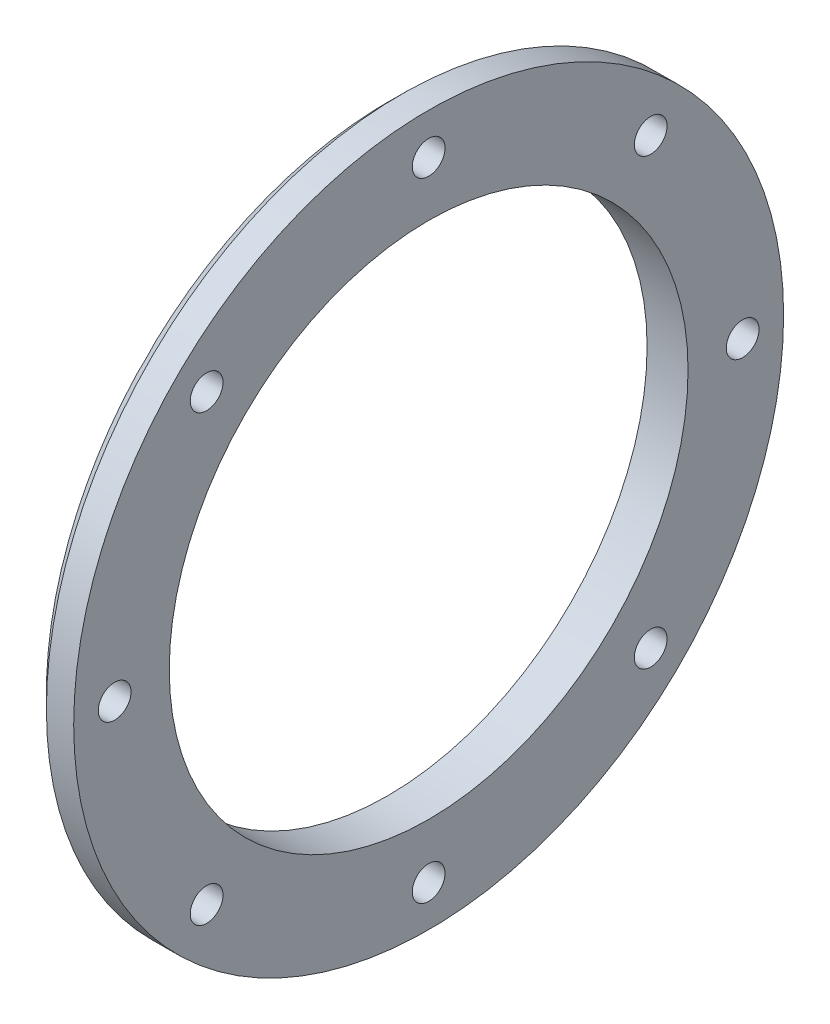
ISO-10303-21;
HEADER;
FILE_DESCRIPTION(('STEP AP214'),'2;1');
FILE_NAME('part.step','',(''),(''),'','','');
FILE_SCHEMA(('AUTOMOTIVE_DESIGN { 1 0 10303 214 1 1 1 1 }'));
ENDSEC;
DATA;
#1=APPLICATION_CONTEXT('core data for automotive mechanical design processes');
#2=APPLICATION_PROTOCOL_DEFINITION('international standard','automotive_design',2000,#1);
#3=PRODUCT_CONTEXT('',#1,'mechanical');
#4=PRODUCT('Part','Part','',(#3));
#5=PRODUCT_RELATED_PRODUCT_CATEGORY('part','',(#4));
#6=PRODUCT_DEFINITION_FORMATION('','',#4);
#7=PRODUCT_DEFINITION_CONTEXT('part definition',#1,'design');
#8=PRODUCT_DEFINITION('design','',#6,#7);
#9=PRODUCT_DEFINITION_SHAPE('','',#8);
#10=(LENGTH_UNIT() NAMED_UNIT(*) SI_UNIT(.MILLI.,.METRE.));
#11=(NAMED_UNIT(*) PLANE_ANGLE_UNIT() SI_UNIT($,.RADIAN.));
#12=(NAMED_UNIT(*) SI_UNIT($,.STERADIAN.) SOLID_ANGLE_UNIT());
#13=UNCERTAINTY_MEASURE_WITH_UNIT(LENGTH_MEASURE(1.E-05),#10,'distance_accuracy_value','');
#14=(GEOMETRIC_REPRESENTATION_CONTEXT(3) GLOBAL_UNCERTAINTY_ASSIGNED_CONTEXT((#13)) GLOBAL_UNIT_ASSIGNED_CONTEXT((#10,
#11,#12)) REPRESENTATION_CONTEXT('',''));
#15=CARTESIAN_POINT('',(0.,0.,0.));
#16=DIRECTION('',(0.,0.,1.));
#17=DIRECTION('',(1.,0.,0.));
#18=AXIS2_PLACEMENT_3D('',#15,#16,#17);
#19=CARTESIAN_POINT('',(0.,0.,0.));
#20=DIRECTION('',(-1.,0.,0.));
#21=DIRECTION('',(0.,0.,1.));
#22=AXIS2_PLACEMENT_3D('',#19,#20,#21);
#23=CYLINDRICAL_SURFACE('',#22,19.);
#24=CARTESIAN_POINT('',(3.,0.,0.));
#25=DIRECTION('',(-1.,0.,0.));
#26=DIRECTION('',(0.,0.,1.));
#27=AXIS2_PLACEMENT_3D('',#24,#25,#26);
#28=CIRCLE('',#27,19.);
#29=CARTESIAN_POINT('',(3.,0.,19.));
#30=VERTEX_POINT('',#29);
#31=EDGE_CURVE('E228',#30,#30,#28,.T.);
#32=ORIENTED_EDGE('',*,*,#31,.F.);
#33=EDGE_LOOP('',(#32));
#34=FACE_BOUND('',#33,.T.);
#35=CARTESIAN_POINT('',(0.,0.,0.));
#36=DIRECTION('',(-1.,0.,0.));
#37=DIRECTION('',(0.,0.,1.));
#38=AXIS2_PLACEMENT_3D('',#35,#36,#37);
#39=CIRCLE('',#38,19.);
#40=CARTESIAN_POINT('',(0.,0.,19.));
#41=VERTEX_POINT('',#40);
#42=EDGE_CURVE('E48',#41,#41,#39,.T.);
#43=ORIENTED_EDGE('',*,*,#42,.T.);
#44=EDGE_LOOP('',(#43));
#45=FACE_BOUND('',#44,.T.);
#46=ADVANCED_FACE('F36',(#34,#45),#23,.F.);
#47=CARTESIAN_POINT('',(0.,19.,0.));
#48=DIRECTION('',(1.,0.,0.));
#49=DIRECTION('',(0.,0.,-1.));
#50=AXIS2_PLACEMENT_3D('',#47,#48,#49);
#51=PLANE('',#50);
#52=ORIENTED_EDGE('',*,*,#42,.F.);
#53=EDGE_LOOP('',(#52));
#54=FACE_BOUND('',#53,.T.);
#55=CARTESIAN_POINT('',(0.,0.,0.));
#56=DIRECTION('',(-1.,0.,0.));
#57=DIRECTION('',(0.,0.,1.));
#58=AXIS2_PLACEMENT_3D('',#55,#56,#57);
#59=CIRCLE('',#58,25.);
#60=CARTESIAN_POINT('',(0.,-16.989216613647,18.3402976762805));
#61=VERTEX_POINT('',#60);
#62=CARTESIAN_POINT('',(0.,-0.955358581320952,24.9817391304348));
#63=VERTEX_POINT('',#62);
#64=EDGE_CURVE('E116',#61,#63,#59,.T.);
#65=ORIENTED_EDGE('',*,*,#64,.T.);
#66=CARTESIAN_POINT('',(0.,0.,23.));
#67=DIRECTION('',(-1.,0.,0.));
#68=DIRECTION('',(0.,-0.707106781186549,0.707106781186546));
#69=AXIS2_PLACEMENT_3D('',#66,#67,#68);
#70=CIRCLE('',#69,2.2);
#71=CARTESIAN_POINT('',(0.,0.955358581320941,24.9817391304348));
#72=VERTEX_POINT('',#71);
#73=EDGE_CURVE('E54',#72,#63,#70,.T.);
#74=ORIENTED_EDGE('',*,*,#73,.F.);
#75=CARTESIAN_POINT('',(0.,16.989216613647,18.3402976762805));
#76=VERTEX_POINT('',#75);
#77=EDGE_CURVE('E114',#72,#76,#59,.T.);
#78=ORIENTED_EDGE('',*,*,#77,.T.);
#79=CARTESIAN_POINT('',(0.,16.2634559672906,16.2634559672906));
#80=DIRECTION('',(-1.,0.,0.));
#81=DIRECTION('',(0.,0.,1.));
#82=AXIS2_PLACEMENT_3D('',#79,#80,#81);
#83=CIRCLE('',#82,2.2);
#84=CARTESIAN_POINT('',(0.,18.3402976762806,16.9892166136469));
#85=VERTEX_POINT('',#84);
#86=EDGE_CURVE('E108',#85,#76,#83,.T.);
#87=ORIENTED_EDGE('',*,*,#86,.F.);
#88=CARTESIAN_POINT('',(0.,24.9817391304348,0.955358581321207));
#89=VERTEX_POINT('',#88);
#90=EDGE_CURVE('E124',#85,#89,#59,.T.);
#91=ORIENTED_EDGE('',*,*,#90,.T.);
#92=CARTESIAN_POINT('',(0.,23.,2.46330733588707E-13));
#93=DIRECTION('',(-1.,0.,0.));
#94=DIRECTION('',(0.,0.707106781186539,0.707106781186556));
#95=AXIS2_PLACEMENT_3D('',#92,#93,#94);
#96=CIRCLE('',#95,2.2);
#97=CARTESIAN_POINT('',(0.,24.9817391304348,-0.955358581320681));
#98=VERTEX_POINT('',#97);
#99=EDGE_CURVE('E282',#98,#89,#96,.T.);
#100=ORIENTED_EDGE('',*,*,#99,.F.);
#101=CARTESIAN_POINT('',(0.,18.3402976762807,-16.9892166136468));
#102=VERTEX_POINT('',#101);
#103=EDGE_CURVE('E130',#98,#102,#59,.T.);
#104=ORIENTED_EDGE('',*,*,#103,.T.);
#105=CARTESIAN_POINT('',(0.,16.2634559672907,-16.2634559672904));
#106=DIRECTION('',(-1.,0.,0.));
#107=DIRECTION('',(0.,1.,0.));
#108=AXIS2_PLACEMENT_3D('',#105,#106,#107);
#109=CIRCLE('',#108,2.2);
#110=CARTESIAN_POINT('',(0.,16.9892166136471,-18.3402976762804));
#111=VERTEX_POINT('',#110);
#112=EDGE_CURVE('E289',#111,#102,#109,.T.);
#113=ORIENTED_EDGE('',*,*,#112,.F.);
#114=CARTESIAN_POINT('',(0.,0.955358581321127,-24.9817391304348));
#115=VERTEX_POINT('',#114);
#116=EDGE_CURVE('E134',#111,#115,#59,.T.);
#117=ORIENTED_EDGE('',*,*,#116,.T.);
#118=CARTESIAN_POINT('',(0.,1.66533453693773E-13,-23.));
#119=DIRECTION('',(-1.,0.,0.));
#120=DIRECTION('',(0.,0.707106781186554,-0.707106781186541));
#121=AXIS2_PLACEMENT_3D('',#118,#119,#120);
#122=CIRCLE('',#121,2.2);
#123=CARTESIAN_POINT('',(0.,-0.955358581320767,-24.9817391304348));
#124=VERTEX_POINT('',#123);
#125=EDGE_CURVE('E328',#124,#115,#122,.T.);
#126=ORIENTED_EDGE('',*,*,#125,.F.);
#127=CARTESIAN_POINT('',(0.,-16.989216613647,-18.3402976762805));
#128=VERTEX_POINT('',#127);
#129=EDGE_CURVE('E138',#124,#128,#59,.T.);
#130=ORIENTED_EDGE('',*,*,#129,.T.);
#131=CARTESIAN_POINT('',(0.,-16.2634559672906,-16.2634559672906));
#132=DIRECTION('',(-1.,0.,0.));
#133=DIRECTION('',(0.,0.,-1.));
#134=AXIS2_PLACEMENT_3D('',#131,#132,#133);
#135=CIRCLE('',#134,2.2);
#136=CARTESIAN_POINT('',(0.,-18.3402976762806,-16.9892166136469));
#137=VERTEX_POINT('',#136);
#138=EDGE_CURVE('E334',#137,#128,#135,.T.);
#139=ORIENTED_EDGE('',*,*,#138,.F.);
#140=CARTESIAN_POINT('',(0.,-24.9817391304348,-0.955358581321025));
#141=VERTEX_POINT('',#140);
#142=EDGE_CURVE('E142',#137,#141,#59,.T.);
#143=ORIENTED_EDGE('',*,*,#142,.T.);
#144=CARTESIAN_POINT('',(0.,-23.,0.));
#145=DIRECTION('',(-1.,0.,0.));
#146=DIRECTION('',(0.,-0.707106781186544,-0.707106781186551));
#147=AXIS2_PLACEMENT_3D('',#144,#145,#146);
#148=CIRCLE('',#147,2.2);
#149=CARTESIAN_POINT('',(0.,-24.9817391304348,0.955358581320854));
#150=VERTEX_POINT('',#149);
#151=EDGE_CURVE('E150',#150,#141,#148,.T.);
#152=ORIENTED_EDGE('',*,*,#151,.F.);
#153=CARTESIAN_POINT('',(0.,-18.3402976762806,16.9892166136469));
#154=VERTEX_POINT('',#153);
#155=EDGE_CURVE('E125',#150,#154,#59,.T.);
#156=ORIENTED_EDGE('',*,*,#155,.T.);
#157=CARTESIAN_POINT('',(0.,-16.2634559672906,16.2634559672906));
#158=DIRECTION('',(-1.,0.,0.));
#159=DIRECTION('',(0.,-1.,0.));
#160=AXIS2_PLACEMENT_3D('',#157,#158,#159);
#161=CIRCLE('',#160,2.2);
#162=EDGE_CURVE('E61',#61,#154,#161,.T.);
#163=ORIENTED_EDGE('',*,*,#162,.F.);
#164=EDGE_LOOP('',(#65,#74,#78,#87,#91,#100,#104,#113,#117,#126,#130,#139,#143,#152,#156,#163));
#165=FACE_BOUND('',#164,.T.);
#166=ADVANCED_FACE('F112',(#54,#165),#51,.F.);
#167=CARTESIAN_POINT('',(1.,0.,0.));
#168=DIRECTION('',(1.,0.,0.));
#169=DIRECTION('',(0.,0.,-1.));
#170=AXIS2_PLACEMENT_3D('',#167,#168,#169);
#171=CONICAL_SURFACE('',#170,26.,0.785398163397447);
#172=ORIENTED_EDGE('',*,*,#77,.F.);
#173=CARTESIAN_POINT('',(-0.0002,0.956309286649606,24.9815026086957));
#174=CARTESIAN_POINT('',(0.0177694926034514,0.871030993264298,25.0027534869273));
#175=CARTESIAN_POINT('',(0.0335009210973286,0.784586897044913,25.0213576110843));
#176=CARTESIAN_POINT('',(0.0601887598013439,0.609894930946425,25.0529188812345));
#177=CARTESIAN_POINT('',(0.0711421182031661,0.521645945819484,25.0658724181328));
#178=CARTESIAN_POINT('',(0.0877207578049991,0.346418157433499,25.0854784614553));
#179=CARTESIAN_POINT('',(0.0934839042542242,0.259470879919546,25.0922940085234));
#180=CARTESIAN_POINT('',(0.100036960868125,0.0851610551651891,25.1000437102311));
#181=CARTESIAN_POINT('',(0.100829115269151,-0.00220128685703239,25.1009805189241));
#182=CARTESIAN_POINT('',(0.0977084453883509,-0.162175447604851,25.0972899875922));
#183=CARTESIAN_POINT('',(0.0945557607601495,-0.234825470343024,25.0935615953337));
#184=CARTESIAN_POINT('',(0.0848451717658176,-0.379578625365199,25.0820777683494));
#185=CARTESIAN_POINT('',(0.0782872586687734,-0.451681756246504,25.0743223232983));
#186=CARTESIAN_POINT('',(0.0616888356022722,-0.596669220070804,25.0546928838501));
#187=CARTESIAN_POINT('',(0.0515698210412525,-0.669531857422675,25.0427260492402));
#188=CARTESIAN_POINT('',(0.0280777857900465,-0.813963079091935,25.0149441640727));
#189=CARTESIAN_POINT('',(0.0147059107489815,-0.885532109501282,24.9991304683696));
#190=CARTESIAN_POINT('',(-0.000200000000000143,-0.956309286649623,24.9815026086957));
#191=B_SPLINE_CURVE_WITH_KNOTS('',3,(#173,#174,#175,#176,#177,#178,#179,#180,#181,#182,#183,
#184,#185,#186,#187,#188,#189,#190),.UNSPECIFIED.,.F.,.F.,(4,2,2,2,2,2,2,2,4),(0.,
0.269090275247996,0.538352170789982,0.800230636032579,1.06199086341174,1.28024339197695,
1.4984964801385,1.72189812645662,1.94522120491508),.UNSPECIFIED.);
#192=EDGE_CURVE('E102',#72,#63,#191,.T.);
#193=ORIENTED_EDGE('',*,*,#192,.T.);
#194=ORIENTED_EDGE('',*,*,#64,.F.);
#195=CARTESIAN_POINT('',(-0.0002,-16.9883771173366,18.3408026803397));
#196=CARTESIAN_POINT('',(0.0177694926034516,-17.0637046169811,18.2955284609027));
#197=CARTESIAN_POINT('',(0.0335009210973287,-17.1379849259608,18.2475583566219));
#198=CARTESIAN_POINT('',(0.0601887598013437,-17.2838279879539,18.1463496709209));
#199=CARTESIAN_POINT('',(0.0711421182031656,-17.3553889775511,18.0931077488859));
#200=CARTESIAN_POINT('',(0.0877207578049979,-17.4931573011568,17.9830665576515));
#201=CARTESIAN_POINT('',(0.0934839042542226,-17.559457630242,17.926404867665));
#202=CARTESIAN_POINT('',(0.100036960868124,-17.6881931559829,17.8086290751834));
#203=CARTESIAN_POINT('',(0.100829115269152,-17.7506300842266,17.7475169944987));
#204=CARTESIAN_POINT('',(0.0977084453883505,-17.861139298375,17.6317885808883));
#205=CARTESIAN_POINT('',(0.0945557607601477,-17.9098742506577,17.5777808857079));
#206=CARTESIAN_POINT('',(0.0848451717658146,-18.0041098962375,17.467304656259));
#207=CARTESIAN_POINT('',(0.0782872586687709,-18.0496105812417,17.4108361156813));
#208=CARTESIAN_POINT('',(0.061688835602271,-18.1382520903541,17.2944343870793));
#209=CARTESIAN_POINT('',(0.051569821041252,-18.1813119254188,17.2344508922107));
#210=CARTESIAN_POINT('',(0.0280777857900469,-18.2637954622801,17.1126778365572));
#211=CARTESIAN_POINT('',(0.0147059107489821,-18.3032204375382,17.0508889183645));
#212=CARTESIAN_POINT('',(-0.000200000000000143,-18.3408026803398,16.9883771173365));
#213=B_SPLINE_CURVE_WITH_KNOTS('',3,(#195,#196,#197,#198,#199,#200,#201,#202,#203,#204,#205,
#206,#207,#208,#209,#210,#211,#212),.UNSPECIFIED.,.F.,.F.,(4,2,2,2,2,2,2,2,4),(0.,
0.269090275247992,0.538352170789981,0.800230636032581,1.06199086341174,1.28024339197695,
1.4984964801385,1.72189812645662,1.94522120491509),.UNSPECIFIED.);
#214=EDGE_CURVE('E153',#61,#154,#213,.T.);
#215=ORIENTED_EDGE('',*,*,#214,.T.);
#216=ORIENTED_EDGE('',*,*,#155,.F.);
#217=CARTESIAN_POINT('',(-0.0002,-24.9815026086957,0.956309286649517));
#218=CARTESIAN_POINT('',(0.0177694926034523,-25.0027534869273,0.87103099326421));
#219=CARTESIAN_POINT('',(0.033500921097329,-25.0213576110843,0.784586897044825));
#220=CARTESIAN_POINT('',(0.0601887598013427,-25.0529188812345,0.609894930946336));
#221=CARTESIAN_POINT('',(0.0711421182031638,-25.0658724181328,0.521645945819396));
#222=CARTESIAN_POINT('',(0.0877207578049964,-25.0854784614553,0.346418157433411));
#223=CARTESIAN_POINT('',(0.0934839042542221,-25.0922940085234,0.259470879919457));
#224=CARTESIAN_POINT('',(0.100036960868124,-25.1000437102311,0.0851610551651005));
#225=CARTESIAN_POINT('',(0.100829115269151,-25.1009805189241,-0.00220128685712105));
#226=CARTESIAN_POINT('',(0.097708445388351,-25.0972899875922,-0.16217544760494));
#227=CARTESIAN_POINT('',(0.0945557607601495,-25.0935615953337,-0.234825470343112));
#228=CARTESIAN_POINT('',(0.0848451717658161,-25.0820777683494,-0.379578625365287));
#229=CARTESIAN_POINT('',(0.0782872586687706,-25.0743223232983,-0.451681756246592));
#230=CARTESIAN_POINT('',(0.0616888356022697,-25.0546928838501,-0.596669220070892));
#231=CARTESIAN_POINT('',(0.0515698210412517,-25.0427260492402,-0.669531857422763));
#232=CARTESIAN_POINT('',(0.028077785790048,-25.0149441640727,-0.813963079092024));
#233=CARTESIAN_POINT('',(0.0147059107489836,-24.9991304683695,-0.885532109501371));
#234=CARTESIAN_POINT('',(-0.000200000000000143,-24.9815026086957,-0.956309286649712));
#235=B_SPLINE_CURVE_WITH_KNOTS('',3,(#217,#218,#219,#220,#221,#222,#223,#224,#225,#226,#227,
#228,#229,#230,#231,#232,#233,#234),.UNSPECIFIED.,.F.,.F.,(4,2,2,2,2,2,2,2,4),(0.,
0.269090275247995,0.538352170789982,0.800230636032579,1.06199086341174,1.28024339197695,
1.4984964801385,1.72189812645662,1.94522120491508),.UNSPECIFIED.);
#236=EDGE_CURVE('E152',#150,#141,#235,.T.);
#237=ORIENTED_EDGE('',*,*,#236,.T.);
#238=ORIENTED_EDGE('',*,*,#142,.F.);
#239=CARTESIAN_POINT('',(-0.0002,-18.3408026803398,-16.9883771173365));
#240=CARTESIAN_POINT('',(0.0177694926034504,-18.2955284609028,-17.063704616981));
#241=CARTESIAN_POINT('',(0.0335009210973272,-18.2475583566219,-17.1379849259607));
#242=CARTESIAN_POINT('',(0.0601887598013422,-18.146349670921,-17.2838279879539));
#243=CARTESIAN_POINT('',(0.0711421182031645,-18.093107748886,-17.3553889775511));
#244=CARTESIAN_POINT('',(0.0877207578049974,-17.9830665576515,-17.4931573011567));
#245=CARTESIAN_POINT('',(0.0934839042542222,-17.9264048676651,-17.5594576302419));
#246=CARTESIAN_POINT('',(0.100036960868124,-17.8086290751835,-17.6881931559828));
#247=CARTESIAN_POINT('',(0.100829115269152,-17.7475169944987,-17.7506300842265));
#248=CARTESIAN_POINT('',(0.0977084453883507,-17.6317885808883,-17.861139298375));
#249=CARTESIAN_POINT('',(0.094555760760148,-17.5777808857079,-17.9098742506576));
#250=CARTESIAN_POINT('',(0.0848451717658148,-17.4673046562591,-18.0041098962374));
#251=CARTESIAN_POINT('',(0.0782872586687706,-17.4108361156813,-18.0496105812416));
#252=CARTESIAN_POINT('',(0.0616888356022705,-17.2944343870794,-18.138252090354));
#253=CARTESIAN_POINT('',(0.051569821041252,-17.2344508922108,-18.1813119254187));
#254=CARTESIAN_POINT('',(0.0280777857900474,-17.1126778365573,-18.26379546228));
#255=CARTESIAN_POINT('',(0.0147059107489827,-17.0508889183646,-18.3032204375381));
#256=CARTESIAN_POINT('',(-0.000200000000000143,-16.9883771173365,-18.3408026803397));
#257=B_SPLINE_CURVE_WITH_KNOTS('',3,(#239,#240,#241,#242,#243,#244,#245,#246,#247,#248,#249,
#250,#251,#252,#253,#254,#255,#256),.UNSPECIFIED.,.F.,.F.,(4,2,2,2,2,2,2,2,4),(0.,
0.269090275247992,0.538352170789978,0.800230636032579,1.06199086341174,1.28024339197695,
1.4984964801385,1.72189812645662,1.94522120491509),.UNSPECIFIED.);
#258=EDGE_CURVE('E319',#137,#128,#257,.T.);
#259=ORIENTED_EDGE('',*,*,#258,.T.);
#260=ORIENTED_EDGE('',*,*,#129,.F.);
#261=CARTESIAN_POINT('',(-0.0002,-0.956309286649431,-24.9815026086957));
#262=CARTESIAN_POINT('',(0.0177694926034524,-0.871030993264123,-25.0027534869273));
#263=CARTESIAN_POINT('',(0.0335009210973295,-0.784586897044739,-25.0213576110843));
#264=CARTESIAN_POINT('',(0.0601887598013442,-0.60989493094625,-25.0529188812345));
#265=CARTESIAN_POINT('',(0.0711421182031658,-0.521645945819309,-25.0658724181328));
#266=CARTESIAN_POINT('',(0.087720757804999,-0.346418157433324,-25.0854784614553));
#267=CARTESIAN_POINT('',(0.0934839042542249,-0.259470879919371,-25.0922940085234));
#268=CARTESIAN_POINT('',(0.100036960868125,-0.0851610551650137,-25.1000437102311));
#269=CARTESIAN_POINT('',(0.100829115269151,0.00220128685720773,-25.1009805189241));
#270=CARTESIAN_POINT('',(0.0977084453883508,0.162175447605027,-25.0972899875922));
#271=CARTESIAN_POINT('',(0.0945557607601499,0.234825470343199,-25.0935615953337));
#272=CARTESIAN_POINT('',(0.0848451717658179,0.379578625365374,-25.0820777683494));
#273=CARTESIAN_POINT('',(0.0782872586687732,0.451681756246679,-25.0743223232983));
#274=CARTESIAN_POINT('',(0.0616888356022722,0.596669220070978,-25.0546928838501));
#275=CARTESIAN_POINT('',(0.0515698210412532,0.66953185742285,-25.0427260492402));
#276=CARTESIAN_POINT('',(0.0280777857900479,0.81396307909211,-25.0149441640727));
#277=CARTESIAN_POINT('',(0.0147059107489829,0.885532109501456,-24.9991304683695));
#278=CARTESIAN_POINT('',(-0.000200000000000143,0.956309286649797,-24.9815026086956));
#279=B_SPLINE_CURVE_WITH_KNOTS('',3,(#261,#262,#263,#264,#265,#266,#267,#268,#269,#270,#271,
#272,#273,#274,#275,#276,#277,#278),.UNSPECIFIED.,.F.,.F.,(4,2,2,2,2,2,2,2,4),(0.,
0.269090275247996,0.538352170789982,0.800230636032579,1.06199086341174,1.28024339197695,
1.4984964801385,1.72189812645662,1.94522120491508),.UNSPECIFIED.);
#280=EDGE_CURVE('E294',#124,#115,#279,.T.);
#281=ORIENTED_EDGE('',*,*,#280,.T.);
#282=ORIENTED_EDGE('',*,*,#116,.F.);
#283=CARTESIAN_POINT('',(-0.0002,16.9883771173367,-18.3408026803396));
#284=CARTESIAN_POINT('',(0.017769492603451,17.0637046169812,-18.2955284609026));
#285=CARTESIAN_POINT('',(0.033500921097328,17.1379849259609,-18.2475583566218));
#286=CARTESIAN_POINT('',(0.0601887598013429,17.2838279879541,-18.1463496709208));
#287=CARTESIAN_POINT('',(0.0711421182031649,17.3553889775513,-18.0931077488858));
#288=CARTESIAN_POINT('',(0.0877207578049971,17.4931573011569,-17.9830665576514));
#289=CARTESIAN_POINT('',(0.0934839042542218,17.5594576302421,-17.9264048676649));
#290=CARTESIAN_POINT('',(0.100036960868123,17.688193155983,-17.8086290751833));
#291=CARTESIAN_POINT('',(0.100829115269151,17.7506300842267,-17.7475169944985));
#292=CARTESIAN_POINT('',(0.0977084453883507,17.8611392983752,-17.6317885808881));
#293=CARTESIAN_POINT('',(0.0945557607601479,17.9098742506578,-17.5777808857078));
#294=CARTESIAN_POINT('',(0.0848451717658141,18.0041098962376,-17.4673046562589));
#295=CARTESIAN_POINT('',(0.0782872586687697,18.0496105812418,-17.4108361156812));
#296=CARTESIAN_POINT('',(0.0616888356022698,18.1382520903542,-17.2944343870792));
#297=CARTESIAN_POINT('',(0.0515698210412516,18.1813119254189,-17.2344508922106));
#298=CARTESIAN_POINT('',(0.0280777857900475,18.2637954622802,-17.1126778365571));
#299=CARTESIAN_POINT('',(0.014705910748983,18.3032204375383,-17.0508889183644));
#300=CARTESIAN_POINT('',(-0.000200000000000143,18.3408026803399,-16.9883771173363));
#301=B_SPLINE_CURVE_WITH_KNOTS('',3,(#283,#284,#285,#286,#287,#288,#289,#290,#291,#292,#293,
#294,#295,#296,#297,#298,#299,#300),.UNSPECIFIED.,.F.,.F.,(4,2,2,2,2,2,2,2,4),(0.,
0.269090275247997,0.538352170789983,0.800230636032583,1.06199086341174,1.28024339197695,
1.4984964801385,1.72189812645662,1.94522120491509),.UNSPECIFIED.);
#302=EDGE_CURVE('E270',#111,#102,#301,.T.);
#303=ORIENTED_EDGE('',*,*,#302,.T.);
#304=ORIENTED_EDGE('',*,*,#103,.F.);
#305=CARTESIAN_POINT('',(-0.0002,24.9815026086957,-0.956309286649346));
#306=CARTESIAN_POINT('',(0.0177694926034531,25.0027534869273,-0.871030993264038));
#307=CARTESIAN_POINT('',(0.0335009210973304,25.0213576110843,-0.784586897044653));
#308=CARTESIAN_POINT('',(0.0601887598013451,25.0529188812345,-0.609894930946164));
#309=CARTESIAN_POINT('',(0.0711421182031666,25.0658724181328,-0.521645945819223));
#310=CARTESIAN_POINT('',(0.0877207578049995,25.0854784614553,-0.346418157433238));
#311=CARTESIAN_POINT('',(0.0934839042542252,25.0922940085234,-0.259470879919284));
#312=CARTESIAN_POINT('',(0.100036960868126,25.1000437102311,-0.085161055164927));
#313=CARTESIAN_POINT('',(0.100829115269151,25.1009805189241,0.00220128685729444));
#314=CARTESIAN_POINT('',(0.0977084453883508,25.0972899875922,0.162175447605113));
#315=CARTESIAN_POINT('',(0.0945557607601499,25.0935615953337,0.234825470343286));
#316=CARTESIAN_POINT('',(0.0848451717658175,25.0820777683494,0.379578625365461));
#317=CARTESIAN_POINT('',(0.0782872586687724,25.0743223232983,0.451681756246766));
#318=CARTESIAN_POINT('',(0.0616888356022714,25.0546928838501,0.596669220071065));
#319=CARTESIAN_POINT('',(0.051569821041253,25.0427260492402,0.669531857422937));
#320=CARTESIAN_POINT('',(0.0280777857900485,25.0149441640727,0.813963079092196));
#321=CARTESIAN_POINT('',(0.0147059107489836,24.9991304683695,0.885532109501543));
#322=CARTESIAN_POINT('',(-0.000200000000000143,24.9815026086956,0.956309286649883));
#323=B_SPLINE_CURVE_WITH_KNOTS('',3,(#305,#306,#307,#308,#309,#310,#311,#312,#313,#314,#315,
#316,#317,#318,#319,#320,#321,#322),.UNSPECIFIED.,.F.,.F.,(4,2,2,2,2,2,2,2,4),(0.,
0.269090275247996,0.538352170789983,0.80023063603258,1.06199086341174,1.28024339197695,
1.4984964801385,1.72189812645662,1.94522120491509),.UNSPECIFIED.);
#324=EDGE_CURVE('E242',#98,#89,#323,.T.);
#325=ORIENTED_EDGE('',*,*,#324,.T.);
#326=ORIENTED_EDGE('',*,*,#90,.F.);
#327=CARTESIAN_POINT('',(-0.0002,18.3408026803398,16.9883771173365));
#328=CARTESIAN_POINT('',(0.0177694926034504,18.2955284609028,17.063704616981));
#329=CARTESIAN_POINT('',(0.0335009210973272,18.2475583566219,17.1379849259607));
#330=CARTESIAN_POINT('',(0.0601887598013422,18.146349670921,17.2838279879539));
#331=CARTESIAN_POINT('',(0.0711421182031645,18.093107748886,17.3553889775511));
#332=CARTESIAN_POINT('',(0.0877207578049974,17.9830665576515,17.4931573011567));
#333=CARTESIAN_POINT('',(0.0934839042542222,17.9264048676651,17.5594576302419));
#334=CARTESIAN_POINT('',(0.100036960868124,17.8086290751835,17.6881931559828));
#335=CARTESIAN_POINT('',(0.100829115269152,17.7475169944987,17.7506300842265));
#336=CARTESIAN_POINT('',(0.0977084453883507,17.6317885808883,17.861139298375));
#337=CARTESIAN_POINT('',(0.094555760760148,17.5777808857079,17.9098742506576));
#338=CARTESIAN_POINT('',(0.0848451717658148,17.4673046562591,18.0041098962374));
#339=CARTESIAN_POINT('',(0.0782872586687706,17.4108361156813,18.0496105812416));
#340=CARTESIAN_POINT('',(0.0616888356022705,17.2944343870794,18.138252090354));
#341=CARTESIAN_POINT('',(0.051569821041252,17.2344508922108,18.1813119254187));
#342=CARTESIAN_POINT('',(0.0280777857900474,17.1126778365573,18.26379546228));
#343=CARTESIAN_POINT('',(0.0147059107489827,17.0508889183646,18.3032204375381));
#344=CARTESIAN_POINT('',(-0.000200000000000143,16.9883771173365,18.3408026803397));
#345=B_SPLINE_CURVE_WITH_KNOTS('',3,(#327,#328,#329,#330,#331,#332,#333,#334,#335,#336,#337,
#338,#339,#340,#341,#342,#343,#344),.UNSPECIFIED.,.F.,.F.,(4,2,2,2,2,2,2,2,4),(0.,
0.269090275247992,0.538352170789978,0.800230636032579,1.06199086341174,1.28024339197695,
1.4984964801385,1.72189812645662,1.94522120491509),.UNSPECIFIED.);
#346=EDGE_CURVE('E11',#85,#76,#345,.T.);
#347=ORIENTED_EDGE('',*,*,#346,.T.);
#348=EDGE_LOOP('',(#172,#193,#194,#215,#216,#237,#238,#259,#260,#281,#282,#303,#304,#325,#326,#347));
#349=FACE_BOUND('',#348,.T.);
#350=CARTESIAN_POINT('',(1.,0.,0.));
#351=DIRECTION('',(-1.,0.,0.));
#352=DIRECTION('',(0.,0.,1.));
#353=AXIS2_PLACEMENT_3D('',#350,#351,#352);
#354=CIRCLE('',#353,26.);
#355=CARTESIAN_POINT('',(1.,0.,26.));
#356=VERTEX_POINT('',#355);
#357=EDGE_CURVE('E122',#356,#356,#354,.T.);
#358=ORIENTED_EDGE('',*,*,#357,.T.);
#359=EDGE_LOOP('',(#358));
#360=FACE_BOUND('',#359,.T.);
#361=ADVANCED_FACE('F119',(#349,#360),#171,.T.);
#362=CARTESIAN_POINT('',(0.,0.,0.));
#363=DIRECTION('',(-1.,0.,0.));
#364=DIRECTION('',(0.,0.,1.));
#365=AXIS2_PLACEMENT_3D('',#362,#363,#364);
#366=CYLINDRICAL_SURFACE('',#365,26.);
#367=ORIENTED_EDGE('',*,*,#357,.F.);
#368=EDGE_LOOP('',(#367));
#369=FACE_BOUND('',#368,.T.);
#370=CARTESIAN_POINT('',(3.,0.,0.));
#371=DIRECTION('',(-1.,0.,0.));
#372=DIRECTION('',(0.,0.,1.));
#373=AXIS2_PLACEMENT_3D('',#370,#371,#372);
#374=CIRCLE('',#373,26.);
#375=CARTESIAN_POINT('',(3.,0.,26.));
#376=VERTEX_POINT('',#375);
#377=EDGE_CURVE('E127',#376,#376,#374,.T.);
#378=ORIENTED_EDGE('',*,*,#377,.T.);
#379=EDGE_LOOP('',(#378));
#380=FACE_BOUND('',#379,.T.);
#381=ADVANCED_FACE('F403',(#369,#380),#366,.T.);
#382=CARTESIAN_POINT('',(3.,26.,0.));
#383=DIRECTION('',(-1.,0.,0.));
#384=DIRECTION('',(0.,0.,1.));
#385=AXIS2_PLACEMENT_3D('',#382,#383,#384);
#386=PLANE('',#385);
#387=CARTESIAN_POINT('',(3.,0.,23.));
#388=DIRECTION('',(-1.,0.,0.));
#389=DIRECTION('',(0.,-0.707106781186549,0.707106781186546));
#390=AXIS2_PLACEMENT_3D('',#387,#388,#389);
#391=CIRCLE('',#390,1.2);
#392=CARTESIAN_POINT('',(3.,-0.848528137423863,23.8485281374239));
#393=VERTEX_POINT('',#392);
#394=EDGE_CURVE('E117',#393,#393,#391,.T.);
#395=ORIENTED_EDGE('',*,*,#394,.T.);
#396=EDGE_LOOP('',(#395));
#397=FACE_BOUND('',#396,.T.);
#398=CARTESIAN_POINT('',(3.,-16.2634559672906,16.2634559672906));
#399=DIRECTION('',(-1.,0.,0.));
#400=DIRECTION('',(0.,-1.,0.));
#401=AXIS2_PLACEMENT_3D('',#398,#399,#400);
#402=CIRCLE('',#401,1.2);
#403=CARTESIAN_POINT('',(3.,-17.4634559672906,16.2634559672906));
#404=VERTEX_POINT('',#403);
#405=EDGE_CURVE('E190',#404,#404,#402,.T.);
#406=ORIENTED_EDGE('',*,*,#405,.T.);
#407=EDGE_LOOP('',(#406));
#408=FACE_BOUND('',#407,.T.);
#409=CARTESIAN_POINT('',(3.,-23.,0.));
#410=DIRECTION('',(-1.,0.,0.));
#411=DIRECTION('',(0.,-0.707106781186544,-0.707106781186551));
#412=AXIS2_PLACEMENT_3D('',#409,#410,#411);
#413=CIRCLE('',#412,1.2);
#414=CARTESIAN_POINT('',(3.,-23.8485281374238,-0.848528137423948));
#415=VERTEX_POINT('',#414);
#416=EDGE_CURVE('E167',#415,#415,#413,.T.);
#417=ORIENTED_EDGE('',*,*,#416,.T.);
#418=EDGE_LOOP('',(#417));
#419=FACE_BOUND('',#418,.T.);
#420=CARTESIAN_POINT('',(3.,-16.2634559672906,-16.2634559672906));
#421=DIRECTION('',(-1.,0.,0.));
#422=DIRECTION('',(0.,0.,-1.));
#423=AXIS2_PLACEMENT_3D('',#420,#421,#422);
#424=CIRCLE('',#423,1.2);
#425=CARTESIAN_POINT('',(3.,-16.2634559672906,-17.4634559672906));
#426=VERTEX_POINT('',#425);
#427=EDGE_CURVE('E204',#426,#426,#424,.T.);
#428=ORIENTED_EDGE('',*,*,#427,.T.);
#429=EDGE_LOOP('',(#428));
#430=FACE_BOUND('',#429,.T.);
#431=CARTESIAN_POINT('',(3.,1.66533453693773E-13,-23.));
#432=DIRECTION('',(-1.,0.,0.));
#433=DIRECTION('',(0.,0.707106781186554,-0.707106781186541));
#434=AXIS2_PLACEMENT_3D('',#431,#432,#433);
#435=CIRCLE('',#434,1.2);
#436=CARTESIAN_POINT('',(3.,0.848528137424031,-23.8485281374238));
#437=VERTEX_POINT('',#436);
#438=EDGE_CURVE('E277',#437,#437,#435,.T.);
#439=ORIENTED_EDGE('',*,*,#438,.T.);
#440=EDGE_LOOP('',(#439));
#441=FACE_BOUND('',#440,.T.);
#442=CARTESIAN_POINT('',(3.,16.2634559672907,-16.2634559672904));
#443=DIRECTION('',(-1.,0.,0.));
#444=DIRECTION('',(0.,1.,0.));
#445=AXIS2_PLACEMENT_3D('',#442,#443,#444);
#446=CIRCLE('',#445,1.2);
#447=CARTESIAN_POINT('',(3.,17.4634559672907,-16.2634559672904));
#448=VERTEX_POINT('',#447);
#449=EDGE_CURVE('E250',#448,#448,#446,.T.);
#450=ORIENTED_EDGE('',*,*,#449,.T.);
#451=EDGE_LOOP('',(#450));
#452=FACE_BOUND('',#451,.T.);
#453=CARTESIAN_POINT('',(3.,23.,2.46330733588707E-13));
#454=DIRECTION('',(-1.,0.,0.));
#455=DIRECTION('',(0.,0.707106781186539,0.707106781186556));
#456=AXIS2_PLACEMENT_3D('',#453,#454,#455);
#457=CIRCLE('',#456,1.2);
#458=CARTESIAN_POINT('',(3.,23.8485281374238,0.848528137424113));
#459=VERTEX_POINT('',#458);
#460=EDGE_CURVE('E280',#459,#459,#457,.T.);
#461=ORIENTED_EDGE('',*,*,#460,.T.);
#462=EDGE_LOOP('',(#461));
#463=FACE_BOUND('',#462,.T.);
#464=CARTESIAN_POINT('',(3.,16.2634559672906,16.2634559672906));
#465=DIRECTION('',(-1.,0.,0.));
#466=DIRECTION('',(0.,0.,1.));
#467=AXIS2_PLACEMENT_3D('',#464,#465,#466);
#468=CIRCLE('',#467,1.2);
#469=CARTESIAN_POINT('',(3.,16.2634559672906,17.4634559672906));
#470=VERTEX_POINT('',#469);
#471=EDGE_CURVE('E231',#470,#470,#468,.T.);
#472=ORIENTED_EDGE('',*,*,#471,.T.);
#473=EDGE_LOOP('',(#472));
#474=FACE_BOUND('',#473,.T.);
#475=ORIENTED_EDGE('',*,*,#377,.F.);
#476=EDGE_LOOP('',(#475));
#477=FACE_BOUND('',#476,.T.);
#478=ORIENTED_EDGE('',*,*,#31,.T.);
#479=EDGE_LOOP('',(#478));
#480=FACE_BOUND('',#479,.T.);
#481=ADVANCED_FACE('F339',(#397,#408,#419,#430,#441,#452,#463,#474,#477,#480),#386,.F.);
#482=CARTESIAN_POINT('',(0.,16.2634559672906,16.2634559672906));
#483=DIRECTION('',(-1.,0.,0.));
#484=DIRECTION('',(0.,0.,1.));
#485=AXIS2_PLACEMENT_3D('',#482,#483,#484);
#486=CONICAL_SURFACE('',#485,2.2,0.785398163397449);
#487=CARTESIAN_POINT('',(1.,16.2634559672906,16.2634559672906));
#488=DIRECTION('',(-1.,0.,0.));
#489=DIRECTION('',(0.,0.,1.));
#490=AXIS2_PLACEMENT_3D('',#487,#488,#489);
#491=CIRCLE('',#490,1.2);
#492=CARTESIAN_POINT('',(1.,16.2634559672906,17.4634559672906));
#493=VERTEX_POINT('',#492);
#494=EDGE_CURVE('E236',#493,#493,#491,.T.);
#495=ORIENTED_EDGE('',*,*,#494,.F.);
#496=EDGE_LOOP('',(#495));
#497=FACE_BOUND('',#496,.T.);
#498=ORIENTED_EDGE('',*,*,#86,.T.);
#499=ORIENTED_EDGE('',*,*,#346,.F.);
#500=EDGE_LOOP('',(#498,#499));
#501=FACE_BOUND('',#500,.T.);
#502=ADVANCED_FACE('F402',(#497,#501),#486,.F.);
#503=CARTESIAN_POINT('',(0.,16.2634559672906,16.2634559672906));
#504=DIRECTION('',(-1.,0.,0.));
#505=DIRECTION('',(0.,0.,1.));
#506=AXIS2_PLACEMENT_3D('',#503,#504,#505);
#507=CYLINDRICAL_SURFACE('',#506,1.2);
#508=ORIENTED_EDGE('',*,*,#471,.F.);
#509=EDGE_LOOP('',(#508));
#510=FACE_BOUND('',#509,.T.);
#511=ORIENTED_EDGE('',*,*,#494,.T.);
#512=EDGE_LOOP('',(#511));
#513=FACE_BOUND('',#512,.T.);
#514=ADVANCED_FACE('F259',(#510,#513),#507,.F.);
#515=CARTESIAN_POINT('',(0.,23.,2.46330733588707E-13));
#516=DIRECTION('',(-1.,0.,0.));
#517=DIRECTION('',(0.,0.707106781186539,0.707106781186556));
#518=AXIS2_PLACEMENT_3D('',#515,#516,#517);
#519=CONICAL_SURFACE('',#518,2.2,0.785398163397449);
#520=CARTESIAN_POINT('',(1.,23.,2.46330733588707E-13));
#521=DIRECTION('',(-1.,0.,0.));
#522=DIRECTION('',(0.,0.707106781186539,0.707106781186556));
#523=AXIS2_PLACEMENT_3D('',#520,#521,#522);
#524=CIRCLE('',#523,1.2);
#525=CARTESIAN_POINT('',(1.,23.8485281374238,0.848528137424113));
#526=VERTEX_POINT('',#525);
#527=EDGE_CURVE('E251',#526,#526,#524,.T.);
#528=ORIENTED_EDGE('',*,*,#527,.F.);
#529=EDGE_LOOP('',(#528));
#530=FACE_BOUND('',#529,.T.);
#531=ORIENTED_EDGE('',*,*,#99,.T.);
#532=ORIENTED_EDGE('',*,*,#324,.F.);
#533=EDGE_LOOP('',(#531,#532));
#534=FACE_BOUND('',#533,.T.);
#535=ADVANCED_FACE('F254',(#530,#534),#519,.F.);
#536=CARTESIAN_POINT('',(0.,23.,2.46330733588707E-13));
#537=DIRECTION('',(-1.,0.,0.));
#538=DIRECTION('',(0.,0.707106781186539,0.707106781186556));
#539=AXIS2_PLACEMENT_3D('',#536,#537,#538);
#540=CYLINDRICAL_SURFACE('',#539,1.2);
#541=ORIENTED_EDGE('',*,*,#460,.F.);
#542=EDGE_LOOP('',(#541));
#543=FACE_BOUND('',#542,.T.);
#544=ORIENTED_EDGE('',*,*,#527,.T.);
#545=EDGE_LOOP('',(#544));
#546=FACE_BOUND('',#545,.T.);
#547=ADVANCED_FACE('F258',(#543,#546),#540,.F.);
#548=CARTESIAN_POINT('',(0.,16.2634559672907,-16.2634559672904));
#549=DIRECTION('',(-1.,0.,0.));
#550=DIRECTION('',(0.,1.,0.));
#551=AXIS2_PLACEMENT_3D('',#548,#549,#550);
#552=CONICAL_SURFACE('',#551,2.2,0.785398163397449);
#553=CARTESIAN_POINT('',(1.,16.2634559672907,-16.2634559672904));
#554=DIRECTION('',(-1.,0.,0.));
#555=DIRECTION('',(0.,1.,0.));
#556=AXIS2_PLACEMENT_3D('',#553,#554,#555);
#557=CIRCLE('',#556,1.2);
#558=CARTESIAN_POINT('',(1.,17.4634559672907,-16.2634559672904));
#559=VERTEX_POINT('',#558);
#560=EDGE_CURVE('E278',#559,#559,#557,.T.);
#561=ORIENTED_EDGE('',*,*,#560,.F.);
#562=EDGE_LOOP('',(#561));
#563=FACE_BOUND('',#562,.T.);
#564=ORIENTED_EDGE('',*,*,#112,.T.);
#565=ORIENTED_EDGE('',*,*,#302,.F.);
#566=EDGE_LOOP('',(#564,#565));
#567=FACE_BOUND('',#566,.T.);
#568=ADVANCED_FACE('F263',(#563,#567),#552,.F.);
#569=CARTESIAN_POINT('',(0.,16.2634559672907,-16.2634559672904));
#570=DIRECTION('',(-1.,0.,0.));
#571=DIRECTION('',(0.,1.,0.));
#572=AXIS2_PLACEMENT_3D('',#569,#570,#571);
#573=CYLINDRICAL_SURFACE('',#572,1.2);
#574=ORIENTED_EDGE('',*,*,#449,.F.);
#575=EDGE_LOOP('',(#574));
#576=FACE_BOUND('',#575,.T.);
#577=ORIENTED_EDGE('',*,*,#560,.T.);
#578=EDGE_LOOP('',(#577));
#579=FACE_BOUND('',#578,.T.);
#580=ADVANCED_FACE('F309',(#576,#579),#573,.F.);
#581=CARTESIAN_POINT('',(0.,1.66533453693773E-13,-23.));
#582=DIRECTION('',(-1.,0.,0.));
#583=DIRECTION('',(0.,0.707106781186554,-0.707106781186541));
#584=AXIS2_PLACEMENT_3D('',#581,#582,#583);
#585=CONICAL_SURFACE('',#584,2.2,0.785398163397449);
#586=CARTESIAN_POINT('',(1.,1.66533453693773E-13,-23.));
#587=DIRECTION('',(-1.,0.,0.));
#588=DIRECTION('',(0.,0.707106781186554,-0.707106781186541));
#589=AXIS2_PLACEMENT_3D('',#586,#587,#588);
#590=CIRCLE('',#589,1.2);
#591=CARTESIAN_POINT('',(1.,0.848528137424031,-23.8485281374238));
#592=VERTEX_POINT('',#591);
#593=EDGE_CURVE('E301',#592,#592,#590,.T.);
#594=ORIENTED_EDGE('',*,*,#593,.F.);
#595=EDGE_LOOP('',(#594));
#596=FACE_BOUND('',#595,.T.);
#597=ORIENTED_EDGE('',*,*,#125,.T.);
#598=ORIENTED_EDGE('',*,*,#280,.F.);
#599=EDGE_LOOP('',(#597,#598));
#600=FACE_BOUND('',#599,.T.);
#601=ADVANCED_FACE('F304',(#596,#600),#585,.F.);
#602=CARTESIAN_POINT('',(0.,1.66533453693773E-13,-23.));
#603=DIRECTION('',(-1.,0.,0.));
#604=DIRECTION('',(0.,0.707106781186554,-0.707106781186541));
#605=AXIS2_PLACEMENT_3D('',#602,#603,#604);
#606=CYLINDRICAL_SURFACE('',#605,1.2);
#607=ORIENTED_EDGE('',*,*,#438,.F.);
#608=EDGE_LOOP('',(#607));
#609=FACE_BOUND('',#608,.T.);
#610=ORIENTED_EDGE('',*,*,#593,.T.);
#611=EDGE_LOOP('',(#610));
#612=FACE_BOUND('',#611,.T.);
#613=ADVANCED_FACE('F308',(#609,#612),#606,.F.);
#614=CARTESIAN_POINT('',(0.,-16.2634559672906,-16.2634559672906));
#615=DIRECTION('',(-1.,0.,0.));
#616=DIRECTION('',(0.,0.,-1.));
#617=AXIS2_PLACEMENT_3D('',#614,#615,#616);
#618=CONICAL_SURFACE('',#617,2.2,0.785398163397449);
#619=CARTESIAN_POINT('',(1.,-16.2634559672906,-16.2634559672906));
#620=DIRECTION('',(-1.,0.,0.));
#621=DIRECTION('',(0.,0.,-1.));
#622=AXIS2_PLACEMENT_3D('',#619,#620,#621);
#623=CIRCLE('',#622,1.2);
#624=CARTESIAN_POINT('',(1.,-16.2634559672906,-17.4634559672906));
#625=VERTEX_POINT('',#624);
#626=EDGE_CURVE('E326',#625,#625,#623,.T.);
#627=ORIENTED_EDGE('',*,*,#626,.F.);
#628=EDGE_LOOP('',(#627));
#629=FACE_BOUND('',#628,.T.);
#630=ORIENTED_EDGE('',*,*,#138,.T.);
#631=ORIENTED_EDGE('',*,*,#258,.F.);
#632=EDGE_LOOP('',(#630,#631));
#633=FACE_BOUND('',#632,.T.);
#634=ADVANCED_FACE('F313',(#629,#633),#618,.F.);
#635=CARTESIAN_POINT('',(0.,-16.2634559672906,-16.2634559672906));
#636=DIRECTION('',(-1.,0.,0.));
#637=DIRECTION('',(0.,0.,-1.));
#638=AXIS2_PLACEMENT_3D('',#635,#636,#637);
#639=CYLINDRICAL_SURFACE('',#638,1.2);
#640=ORIENTED_EDGE('',*,*,#427,.F.);
#641=EDGE_LOOP('',(#640));
#642=FACE_BOUND('',#641,.T.);
#643=ORIENTED_EDGE('',*,*,#626,.T.);
#644=EDGE_LOOP('',(#643));
#645=FACE_BOUND('',#644,.T.);
#646=ADVANCED_FACE('F211',(#642,#645),#639,.F.);
#647=CARTESIAN_POINT('',(0.,-23.,0.));
#648=DIRECTION('',(-1.,0.,0.));
#649=DIRECTION('',(0.,-0.707106781186544,-0.707106781186551));
#650=AXIS2_PLACEMENT_3D('',#647,#648,#649);
#651=CONICAL_SURFACE('',#650,2.2,0.785398163397449);
#652=CARTESIAN_POINT('',(1.,-23.,0.));
#653=DIRECTION('',(-1.,0.,0.));
#654=DIRECTION('',(0.,-0.707106781186544,-0.707106781186551));
#655=AXIS2_PLACEMENT_3D('',#652,#653,#654);
#656=CIRCLE('',#655,1.2);
#657=CARTESIAN_POINT('',(1.,-23.8485281374238,-0.848528137423948));
#658=VERTEX_POINT('',#657);
#659=EDGE_CURVE('E194',#658,#658,#656,.T.);
#660=ORIENTED_EDGE('',*,*,#659,.F.);
#661=EDGE_LOOP('',(#660));
#662=FACE_BOUND('',#661,.T.);
#663=ORIENTED_EDGE('',*,*,#151,.T.);
#664=ORIENTED_EDGE('',*,*,#236,.F.);
#665=EDGE_LOOP('',(#663,#664));
#666=FACE_BOUND('',#665,.T.);
#667=ADVANCED_FACE('F208',(#662,#666),#651,.F.);
#668=CARTESIAN_POINT('',(0.,-23.,0.));
#669=DIRECTION('',(-1.,0.,0.));
#670=DIRECTION('',(0.,-0.707106781186544,-0.707106781186551));
#671=AXIS2_PLACEMENT_3D('',#668,#669,#670);
#672=CYLINDRICAL_SURFACE('',#671,1.2);
#673=ORIENTED_EDGE('',*,*,#416,.F.);
#674=EDGE_LOOP('',(#673));
#675=FACE_BOUND('',#674,.T.);
#676=ORIENTED_EDGE('',*,*,#659,.T.);
#677=EDGE_LOOP('',(#676));
#678=FACE_BOUND('',#677,.T.);
#679=ADVANCED_FACE('F176',(#675,#678),#672,.F.);
#680=CARTESIAN_POINT('',(0.,-16.2634559672906,16.2634559672906));
#681=DIRECTION('',(-1.,0.,0.));
#682=DIRECTION('',(0.,-1.,0.));
#683=AXIS2_PLACEMENT_3D('',#680,#681,#682);
#684=CONICAL_SURFACE('',#683,2.2,0.785398163397449);
#685=CARTESIAN_POINT('',(1.,-16.2634559672906,16.2634559672906));
#686=DIRECTION('',(-1.,0.,0.));
#687=DIRECTION('',(0.,-1.,0.));
#688=AXIS2_PLACEMENT_3D('',#685,#686,#687);
#689=CIRCLE('',#688,1.2);
#690=CARTESIAN_POINT('',(1.,-17.4634559672906,16.2634559672906));
#691=VERTEX_POINT('',#690);
#692=EDGE_CURVE('E154',#691,#691,#689,.T.);
#693=ORIENTED_EDGE('',*,*,#692,.F.);
#694=EDGE_LOOP('',(#693));
#695=FACE_BOUND('',#694,.T.);
#696=ORIENTED_EDGE('',*,*,#162,.T.);
#697=ORIENTED_EDGE('',*,*,#214,.F.);
#698=EDGE_LOOP('',(#696,#697));
#699=FACE_BOUND('',#698,.T.);
#700=ADVANCED_FACE('F171',(#695,#699),#684,.F.);
#701=CARTESIAN_POINT('',(0.,-16.2634559672906,16.2634559672906));
#702=DIRECTION('',(-1.,0.,0.));
#703=DIRECTION('',(0.,-1.,0.));
#704=AXIS2_PLACEMENT_3D('',#701,#702,#703);
#705=CYLINDRICAL_SURFACE('',#704,1.2);
#706=ORIENTED_EDGE('',*,*,#405,.F.);
#707=EDGE_LOOP('',(#706));
#708=FACE_BOUND('',#707,.T.);
#709=ORIENTED_EDGE('',*,*,#692,.T.);
#710=EDGE_LOOP('',(#709));
#711=FACE_BOUND('',#710,.T.);
#712=ADVANCED_FACE('F175',(#708,#711),#705,.F.);
#713=CARTESIAN_POINT('',(0.,0.,23.));
#714=DIRECTION('',(-1.,0.,0.));
#715=DIRECTION('',(0.,-0.707106781186549,0.707106781186546));
#716=AXIS2_PLACEMENT_3D('',#713,#714,#715);
#717=CONICAL_SURFACE('',#716,2.2,0.785398163397449);
#718=CARTESIAN_POINT('',(1.,0.,23.));
#719=DIRECTION('',(-1.,0.,0.));
#720=DIRECTION('',(0.,-0.707106781186549,0.707106781186546));
#721=AXIS2_PLACEMENT_3D('',#718,#719,#720);
#722=CIRCLE('',#721,1.2);
#723=CARTESIAN_POINT('',(1.,-0.848528137423863,23.8485281374239));
#724=VERTEX_POINT('',#723);
#725=EDGE_CURVE('E109',#724,#724,#722,.T.);
#726=ORIENTED_EDGE('',*,*,#725,.F.);
#727=EDGE_LOOP('',(#726));
#728=FACE_BOUND('',#727,.T.);
#729=ORIENTED_EDGE('',*,*,#73,.T.);
#730=ORIENTED_EDGE('',*,*,#192,.F.);
#731=EDGE_LOOP('',(#729,#730));
#732=FACE_BOUND('',#731,.T.);
#733=ADVANCED_FACE('F103',(#728,#732),#717,.F.);
#734=CARTESIAN_POINT('',(0.,0.,23.));
#735=DIRECTION('',(-1.,0.,0.));
#736=DIRECTION('',(0.,-0.707106781186549,0.707106781186546));
#737=AXIS2_PLACEMENT_3D('',#734,#735,#736);
#738=CYLINDRICAL_SURFACE('',#737,1.2);
#739=ORIENTED_EDGE('',*,*,#394,.F.);
#740=EDGE_LOOP('',(#739));
#741=FACE_BOUND('',#740,.T.);
#742=ORIENTED_EDGE('',*,*,#725,.T.);
#743=EDGE_LOOP('',(#742));
#744=FACE_BOUND('',#743,.T.);
#745=ADVANCED_FACE('F384',(#741,#744),#738,.F.);
#746=CLOSED_SHELL('',(#46,#166,#361,#381,#481,#502,#514,#535,#547,#568,#580,#601,#613,#634,#646,
#667,#679,#700,#712,#733,#745));
#747=MANIFOLD_SOLID_BREP('B2',#746);
#748=ADVANCED_BREP_SHAPE_REPRESENTATION('',(#18,#747),#14);
#749=SHAPE_DEFINITION_REPRESENTATION(#9,#748);
ENDSEC;
END-ISO-10303-21;
